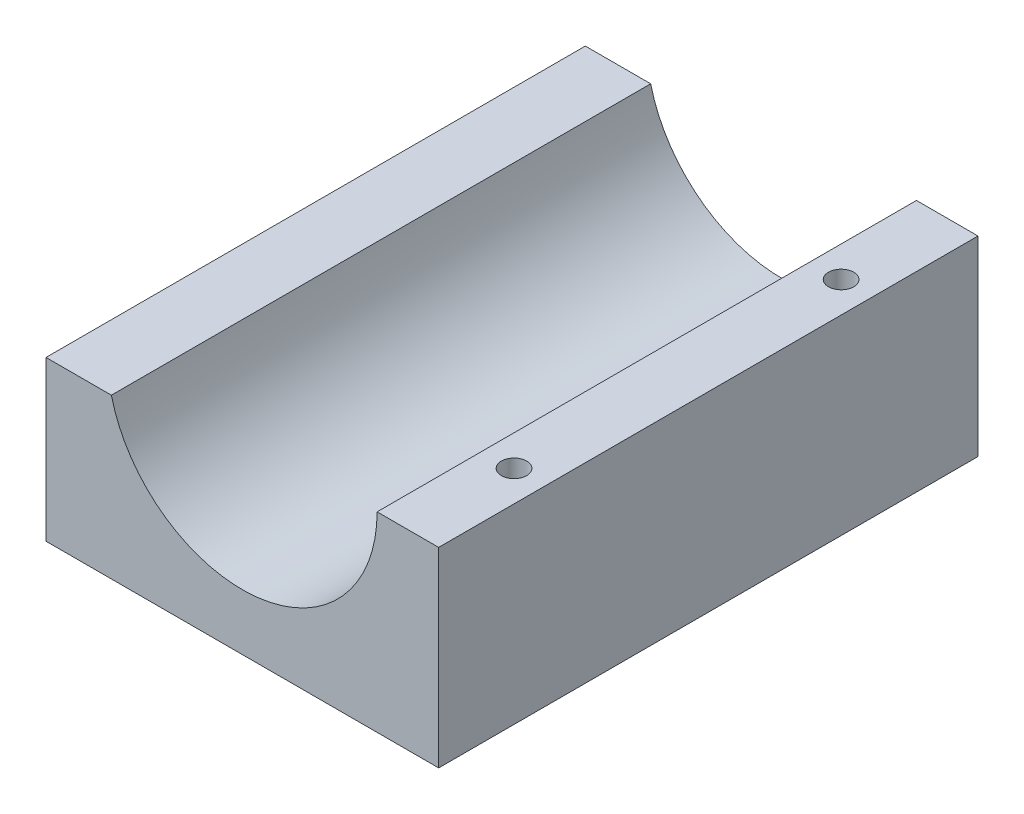
ISO-10303-21;
HEADER;
FILE_DESCRIPTION(('STEP AP214'),'2;1');
FILE_NAME('part.step','',(''),(''),'','','');
FILE_SCHEMA(('AUTOMOTIVE_DESIGN { 1 0 10303 214 1 1 1 1 }'));
ENDSEC;
DATA;
#1=APPLICATION_CONTEXT('core data for automotive mechanical design processes');
#2=APPLICATION_PROTOCOL_DEFINITION('international standard','automotive_design',2000,#1);
#3=PRODUCT_CONTEXT('',#1,'mechanical');
#4=PRODUCT('Part','Part','',(#3));
#5=PRODUCT_RELATED_PRODUCT_CATEGORY('part','',(#4));
#6=PRODUCT_DEFINITION_FORMATION('','',#4);
#7=PRODUCT_DEFINITION_CONTEXT('part definition',#1,'design');
#8=PRODUCT_DEFINITION('design','',#6,#7);
#9=PRODUCT_DEFINITION_SHAPE('','',#8);
#10=(LENGTH_UNIT() NAMED_UNIT(*) SI_UNIT(.MILLI.,.METRE.));
#11=(NAMED_UNIT(*) PLANE_ANGLE_UNIT() SI_UNIT($,.RADIAN.));
#12=(NAMED_UNIT(*) SI_UNIT($,.STERADIAN.) SOLID_ANGLE_UNIT());
#13=UNCERTAINTY_MEASURE_WITH_UNIT(LENGTH_MEASURE(1.E-05),#10,'distance_accuracy_value','');
#14=(GEOMETRIC_REPRESENTATION_CONTEXT(3) GLOBAL_UNCERTAINTY_ASSIGNED_CONTEXT((#13)) GLOBAL_UNIT_ASSIGNED_CONTEXT((#10,
#11,#12)) REPRESENTATION_CONTEXT('',''));
#15=CARTESIAN_POINT('',(0.,0.,0.));
#16=DIRECTION('',(0.,0.,1.));
#17=DIRECTION('',(1.,0.,0.));
#18=AXIS2_PLACEMENT_3D('',#15,#16,#17);
#19=CARTESIAN_POINT('',(0.,9.,0.));
#20=DIRECTION('',(1.,0.,0.));
#21=DIRECTION('',(0.,0.,-1.));
#22=AXIS2_PLACEMENT_3D('',#19,#20,#21);
#23=PLANE('',#22);
#24=DIRECTION('',(0.,0.,1.));
#25=VECTOR('',#24,1.);
#26=CARTESIAN_POINT('',(0.,7.5,-66.2778912014065));
#27=LINE('',#26,#25);
#28=CARTESIAN_POINT('',(0.,7.5,-25.41));
#29=VERTEX_POINT('',#28);
#30=CARTESIAN_POINT('',(0.,7.5,0.));
#31=VERTEX_POINT('',#30);
#32=EDGE_CURVE('E93',#29,#31,#27,.T.);
#33=ORIENTED_EDGE('',*,*,#32,.F.);
#34=DIRECTION('',(0.,-1.,0.));
#35=VECTOR('',#34,1.);
#36=CARTESIAN_POINT('',(0.,9.,-25.41));
#37=LINE('',#36,#35);
#38=CARTESIAN_POINT('',(0.,0.,-25.41));
#39=VERTEX_POINT('',#38);
#40=EDGE_CURVE('E87',#29,#39,#37,.T.);
#41=ORIENTED_EDGE('',*,*,#40,.T.);
#42=DIRECTION('',(0.,0.,1.));
#43=VECTOR('',#42,1.);
#44=CARTESIAN_POINT('',(0.,0.,0.));
#45=LINE('',#44,#43);
#46=CARTESIAN_POINT('',(0.,0.,0.));
#47=VERTEX_POINT('',#46);
#48=EDGE_CURVE('E91',#39,#47,#45,.T.);
#49=ORIENTED_EDGE('',*,*,#48,.T.);
#50=DIRECTION('',(0.,-1.,0.));
#51=VECTOR('',#50,1.);
#52=CARTESIAN_POINT('',(0.,9.,0.));
#53=LINE('',#52,#51);
#54=EDGE_CURVE('E52',#31,#47,#53,.T.);
#55=ORIENTED_EDGE('',*,*,#54,.F.);
#56=EDGE_LOOP('',(#33,#41,#49,#55));
#57=FACE_BOUND('',#56,.T.);
#58=ADVANCED_FACE('F45',(#57),#23,.F.);
#59=CARTESIAN_POINT('',(0.,9.,-25.41));
#60=DIRECTION('',(0.,0.,1.));
#61=DIRECTION('',(1.,0.,0.));
#62=AXIS2_PLACEMENT_3D('',#59,#60,#61);
#63=PLANE('',#62);
#64=DIRECTION('',(-1.,0.,0.));
#65=VECTOR('',#64,1.);
#66=CARTESIAN_POINT('',(0.,7.5,-25.41));
#67=LINE('',#66,#65);
#68=CARTESIAN_POINT('',(3.07970827269893,7.5,-25.41));
#69=VERTEX_POINT('',#68);
#70=EDGE_CURVE('E171',#69,#29,#67,.T.);
#71=ORIENTED_EDGE('',*,*,#70,.F.);
#72=CARTESIAN_POINT('',(9.25,9.,-25.41));
#73=DIRECTION('',(0.,0.,1.));
#74=DIRECTION('',(1.,0.,0.));
#75=AXIS2_PLACEMENT_3D('',#72,#73,#74);
#76=CIRCLE('',#75,6.35);
#77=CARTESIAN_POINT('',(15.6,9.,-25.41));
#78=VERTEX_POINT('',#77);
#79=EDGE_CURVE('E116',#69,#78,#76,.T.);
#80=ORIENTED_EDGE('',*,*,#79,.T.);
#81=DIRECTION('',(-1.,0.,0.));
#82=VECTOR('',#81,1.);
#83=CARTESIAN_POINT('',(0.,9.,-25.41));
#84=LINE('',#83,#82);
#85=CARTESIAN_POINT('',(18.5,9.,-25.41));
#86=VERTEX_POINT('',#85);
#87=EDGE_CURVE('E97',#86,#78,#84,.T.);
#88=ORIENTED_EDGE('',*,*,#87,.F.);
#89=DIRECTION('',(0.,-1.,0.));
#90=VECTOR('',#89,1.);
#91=CARTESIAN_POINT('',(18.5,9.,-25.41));
#92=LINE('',#91,#90);
#93=CARTESIAN_POINT('',(18.5,0.,-25.41));
#94=VERTEX_POINT('',#93);
#95=EDGE_CURVE('E96',#86,#94,#92,.T.);
#96=ORIENTED_EDGE('',*,*,#95,.T.);
#97=DIRECTION('',(-1.,0.,0.));
#98=VECTOR('',#97,1.);
#99=CARTESIAN_POINT('',(0.,0.,-25.41));
#100=LINE('',#99,#98);
#101=EDGE_CURVE('E101',#94,#39,#100,.T.);
#102=ORIENTED_EDGE('',*,*,#101,.T.);
#103=ORIENTED_EDGE('',*,*,#40,.F.);
#104=EDGE_LOOP('',(#71,#80,#88,#96,#102,#103));
#105=FACE_BOUND('',#104,.T.);
#106=ADVANCED_FACE('F102',(#105),#63,.F.);
#107=CARTESIAN_POINT('',(0.,9.,0.));
#108=DIRECTION('',(0.,-1.,0.));
#109=DIRECTION('',(0.,0.,-1.));
#110=AXIS2_PLACEMENT_3D('',#107,#108,#109);
#111=PLANE('',#110);
#112=CARTESIAN_POINT('',(17.05,9.,-20.41));
#113=DIRECTION('',(0.,1.,0.));
#114=DIRECTION('',(0.,0.,1.));
#115=AXIS2_PLACEMENT_3D('',#112,#113,#114);
#116=CIRCLE('',#115,0.59563);
#117=CARTESIAN_POINT('',(17.05,9.,-19.81437));
#118=VERTEX_POINT('',#117);
#119=EDGE_CURVE('E167',#118,#118,#116,.T.);
#120=ORIENTED_EDGE('',*,*,#119,.F.);
#121=EDGE_LOOP('',(#120));
#122=FACE_BOUND('',#121,.T.);
#123=CARTESIAN_POINT('',(17.05,9.,-5.));
#124=DIRECTION('',(0.,1.,0.));
#125=DIRECTION('',(0.,0.,1.));
#126=AXIS2_PLACEMENT_3D('',#123,#124,#125);
#127=CIRCLE('',#126,0.59563);
#128=CARTESIAN_POINT('',(17.05,9.,-4.40437));
#129=VERTEX_POINT('',#128);
#130=EDGE_CURVE('E161',#129,#129,#127,.T.);
#131=ORIENTED_EDGE('',*,*,#130,.F.);
#132=EDGE_LOOP('',(#131));
#133=FACE_BOUND('',#132,.T.);
#134=ORIENTED_EDGE('',*,*,#87,.T.);
#135=DIRECTION('',(0.,0.,1.));
#136=VECTOR('',#135,1.);
#137=CARTESIAN_POINT('',(15.6,9.,-25.41));
#138=LINE('',#137,#136);
#139=CARTESIAN_POINT('',(15.6,9.,0.));
#140=VERTEX_POINT('',#139);
#141=EDGE_CURVE('E112',#78,#140,#138,.T.);
#142=ORIENTED_EDGE('',*,*,#141,.T.);
#143=DIRECTION('',(1.,0.,0.));
#144=VECTOR('',#143,1.);
#145=CARTESIAN_POINT('',(0.,9.,0.));
#146=LINE('',#145,#144);
#147=CARTESIAN_POINT('',(18.5,9.,0.));
#148=VERTEX_POINT('',#147);
#149=EDGE_CURVE('E106',#140,#148,#146,.T.);
#150=ORIENTED_EDGE('',*,*,#149,.T.);
#151=DIRECTION('',(0.,0.,-1.));
#152=VECTOR('',#151,1.);
#153=CARTESIAN_POINT('',(18.5,9.,0.));
#154=LINE('',#153,#152);
#155=EDGE_CURVE('E67',#148,#86,#154,.T.);
#156=ORIENTED_EDGE('',*,*,#155,.T.);
#157=EDGE_LOOP('',(#134,#142,#150,#156));
#158=FACE_BOUND('',#157,.T.);
#159=ADVANCED_FACE('F155',(#122,#133,#158),#111,.F.);
#160=CARTESIAN_POINT('',(0.,9.,0.));
#161=DIRECTION('',(0.,0.,-1.));
#162=DIRECTION('',(-1.,0.,0.));
#163=AXIS2_PLACEMENT_3D('',#160,#161,#162);
#164=PLANE('',#163);
#165=CARTESIAN_POINT('',(9.25,9.,0.));
#166=DIRECTION('',(0.,0.,1.));
#167=DIRECTION('',(1.,0.,0.));
#168=AXIS2_PLACEMENT_3D('',#165,#166,#167);
#169=CIRCLE('',#168,6.35);
#170=CARTESIAN_POINT('',(3.07970827269893,7.5,0.));
#171=VERTEX_POINT('',#170);
#172=EDGE_CURVE('E149',#171,#140,#169,.T.);
#173=ORIENTED_EDGE('',*,*,#172,.F.);
#174=DIRECTION('',(-1.,0.,0.));
#175=VECTOR('',#174,1.);
#176=CARTESIAN_POINT('',(0.,7.5,0.));
#177=LINE('',#176,#175);
#178=EDGE_CURVE('E59',#171,#31,#177,.T.);
#179=ORIENTED_EDGE('',*,*,#178,.T.);
#180=ORIENTED_EDGE('',*,*,#54,.T.);
#181=DIRECTION('',(1.,0.,0.));
#182=VECTOR('',#181,1.);
#183=CARTESIAN_POINT('',(0.,0.,0.));
#184=LINE('',#183,#182);
#185=CARTESIAN_POINT('',(18.5,0.,0.));
#186=VERTEX_POINT('',#185);
#187=EDGE_CURVE('E111',#47,#186,#184,.T.);
#188=ORIENTED_EDGE('',*,*,#187,.T.);
#189=DIRECTION('',(0.,-1.,0.));
#190=VECTOR('',#189,1.);
#191=CARTESIAN_POINT('',(18.5,9.,0.));
#192=LINE('',#191,#190);
#193=EDGE_CURVE('E123',#148,#186,#192,.T.);
#194=ORIENTED_EDGE('',*,*,#193,.F.);
#195=ORIENTED_EDGE('',*,*,#149,.F.);
#196=EDGE_LOOP('',(#173,#179,#180,#188,#194,#195));
#197=FACE_BOUND('',#196,.T.);
#198=ADVANCED_FACE('F127',(#197),#164,.F.);
#199=CARTESIAN_POINT('',(18.5,9.,0.));
#200=DIRECTION('',(-1.,0.,0.));
#201=DIRECTION('',(0.,0.,1.));
#202=AXIS2_PLACEMENT_3D('',#199,#200,#201);
#203=PLANE('',#202);
#204=DIRECTION('',(0.,0.,-1.));
#205=VECTOR('',#204,1.);
#206=CARTESIAN_POINT('',(18.5,0.,0.));
#207=LINE('',#206,#205);
#208=EDGE_CURVE('E107',#186,#94,#207,.T.);
#209=ORIENTED_EDGE('',*,*,#208,.T.);
#210=ORIENTED_EDGE('',*,*,#95,.F.);
#211=ORIENTED_EDGE('',*,*,#155,.F.);
#212=ORIENTED_EDGE('',*,*,#193,.T.);
#213=EDGE_LOOP('',(#209,#210,#211,#212));
#214=FACE_BOUND('',#213,.T.);
#215=ADVANCED_FACE('F191',(#214),#203,.F.);
#216=CARTESIAN_POINT('',(0.,0.,0.));
#217=DIRECTION('',(0.,-1.,0.));
#218=DIRECTION('',(0.,0.,-1.));
#219=AXIS2_PLACEMENT_3D('',#216,#217,#218);
#220=PLANE('',#219);
#221=CARTESIAN_POINT('',(17.,0.,-12.705));
#222=DIRECTION('',(0.,-1.,0.));
#223=DIRECTION('',(0.,0.,-1.));
#224=AXIS2_PLACEMENT_3D('',#221,#222,#223);
#225=CIRCLE('',#224,0.88899999999999);
#226=CARTESIAN_POINT('',(17.,0.,-13.594));
#227=VERTEX_POINT('',#226);
#228=EDGE_CURVE('E183',#227,#227,#225,.T.);
#229=ORIENTED_EDGE('',*,*,#228,.F.);
#230=EDGE_LOOP('',(#229));
#231=FACE_BOUND('',#230,.T.);
#232=CARTESIAN_POINT('',(1.5,0.,-12.705));
#233=DIRECTION('',(0.,-1.,0.));
#234=DIRECTION('',(0.,0.,-1.));
#235=AXIS2_PLACEMENT_3D('',#232,#233,#234);
#236=CIRCLE('',#235,0.888999999999989);
#237=CARTESIAN_POINT('',(1.5,0.,-13.594));
#238=VERTEX_POINT('',#237);
#239=EDGE_CURVE('E177',#238,#238,#236,.T.);
#240=ORIENTED_EDGE('',*,*,#239,.F.);
#241=EDGE_LOOP('',(#240));
#242=FACE_BOUND('',#241,.T.);
#243=ORIENTED_EDGE('',*,*,#48,.F.);
#244=ORIENTED_EDGE('',*,*,#101,.F.);
#245=ORIENTED_EDGE('',*,*,#208,.F.);
#246=ORIENTED_EDGE('',*,*,#187,.F.);
#247=EDGE_LOOP('',(#243,#244,#245,#246));
#248=FACE_BOUND('',#247,.T.);
#249=ADVANCED_FACE('F110',(#231,#242,#248),#220,.T.);
#250=CARTESIAN_POINT('',(9.25,9.,-25.41));
#251=DIRECTION('',(0.,0.,1.));
#252=DIRECTION('',(1.,0.,0.));
#253=AXIS2_PLACEMENT_3D('',#250,#251,#252);
#254=CYLINDRICAL_SURFACE('',#253,6.35);
#255=ORIENTED_EDGE('',*,*,#79,.F.);
#256=DIRECTION('',(0.,0.,1.));
#257=VECTOR('',#256,1.);
#258=CARTESIAN_POINT('',(3.07970827269893,7.5,-25.41));
#259=LINE('',#258,#257);
#260=EDGE_CURVE('E11',#69,#171,#259,.T.);
#261=ORIENTED_EDGE('',*,*,#260,.T.);
#262=ORIENTED_EDGE('',*,*,#172,.T.);
#263=ORIENTED_EDGE('',*,*,#141,.F.);
#264=EDGE_LOOP('',(#255,#261,#262,#263));
#265=FACE_BOUND('',#264,.T.);
#266=ADVANCED_FACE('F151',(#265),#254,.F.);
#267=CARTESIAN_POINT('',(17.05,5.35789061051138,-5.));
#268=DIRECTION('',(0.,1.,0.));
#269=DIRECTION('',(0.,0.,1.));
#270=AXIS2_PLACEMENT_3D('',#267,#268,#269);
#271=CONICAL_SURFACE('',#270,0.59563,1.02974425867665);
#272=CARTESIAN_POINT('',(17.05,5.,-5.));
#273=VERTEX_POINT('',#272);
#274=VERTEX_LOOP('',#273);
#275=FACE_BOUND('',#274,.T.);
#276=CARTESIAN_POINT('',(17.05,5.35789061051138,-5.));
#277=DIRECTION('',(0.,1.,0.));
#278=DIRECTION('',(0.,0.,1.));
#279=AXIS2_PLACEMENT_3D('',#276,#277,#278);
#280=CIRCLE('',#279,0.59563);
#281=CARTESIAN_POINT('',(17.05,5.35789061051138,-4.40437));
#282=VERTEX_POINT('',#281);
#283=EDGE_CURVE('E153',#282,#282,#280,.T.);
#284=ORIENTED_EDGE('',*,*,#283,.T.);
#285=EDGE_LOOP('',(#284));
#286=FACE_BOUND('',#285,.T.);
#287=ADVANCED_FACE('F245',(#275,#286),#271,.F.);
#288=CARTESIAN_POINT('',(17.05,9.,-5.));
#289=DIRECTION('',(0.,1.,0.));
#290=DIRECTION('',(0.,0.,1.));
#291=AXIS2_PLACEMENT_3D('',#288,#289,#290);
#292=CYLINDRICAL_SURFACE('',#291,0.59563);
#293=ORIENTED_EDGE('',*,*,#283,.F.);
#294=EDGE_LOOP('',(#293));
#295=FACE_BOUND('',#294,.T.);
#296=ORIENTED_EDGE('',*,*,#130,.T.);
#297=EDGE_LOOP('',(#296));
#298=FACE_BOUND('',#297,.T.);
#299=ADVANCED_FACE('F253',(#295,#298),#292,.F.);
#300=CARTESIAN_POINT('',(17.05,5.35789061051138,-20.41));
#301=DIRECTION('',(0.,1.,0.));
#302=DIRECTION('',(0.,0.,1.));
#303=AXIS2_PLACEMENT_3D('',#300,#301,#302);
#304=CONICAL_SURFACE('',#303,0.59563,1.02974425867665);
#305=CARTESIAN_POINT('',(17.05,5.,-20.41));
#306=VERTEX_POINT('',#305);
#307=VERTEX_LOOP('',#306);
#308=FACE_BOUND('',#307,.T.);
#309=CARTESIAN_POINT('',(17.05,5.35789061051138,-20.41));
#310=DIRECTION('',(0.,1.,0.));
#311=DIRECTION('',(0.,0.,1.));
#312=AXIS2_PLACEMENT_3D('',#309,#310,#311);
#313=CIRCLE('',#312,0.59563);
#314=CARTESIAN_POINT('',(17.05,5.35789061051138,-19.81437));
#315=VERTEX_POINT('',#314);
#316=EDGE_CURVE('E164',#315,#315,#313,.T.);
#317=ORIENTED_EDGE('',*,*,#316,.T.);
#318=EDGE_LOOP('',(#317));
#319=FACE_BOUND('',#318,.T.);
#320=ADVANCED_FACE('F262',(#308,#319),#304,.F.);
#321=CARTESIAN_POINT('',(17.05,9.,-20.41));
#322=DIRECTION('',(0.,1.,0.));
#323=DIRECTION('',(0.,0.,1.));
#324=AXIS2_PLACEMENT_3D('',#321,#322,#323);
#325=CYLINDRICAL_SURFACE('',#324,0.59563);
#326=ORIENTED_EDGE('',*,*,#316,.F.);
#327=EDGE_LOOP('',(#326));
#328=FACE_BOUND('',#327,.T.);
#329=ORIENTED_EDGE('',*,*,#119,.T.);
#330=EDGE_LOOP('',(#329));
#331=FACE_BOUND('',#330,.T.);
#332=ADVANCED_FACE('F271',(#328,#331),#325,.F.);
#333=CARTESIAN_POINT('',(0.,7.5,-66.2778912014065));
#334=DIRECTION('',(0.,-1.,0.));
#335=DIRECTION('',(0.,0.,-1.));
#336=AXIS2_PLACEMENT_3D('',#333,#334,#335);
#337=PLANE('',#336);
#338=ORIENTED_EDGE('',*,*,#260,.F.);
#339=ORIENTED_EDGE('',*,*,#70,.T.);
#340=ORIENTED_EDGE('',*,*,#32,.T.);
#341=ORIENTED_EDGE('',*,*,#178,.F.);
#342=EDGE_LOOP('',(#338,#339,#340,#341));
#343=FACE_BOUND('',#342,.T.);
#344=ADVANCED_FACE('F207',(#343),#337,.F.);
#345=CARTESIAN_POINT('',(1.5,3.4658349096845,-12.705));
#346=DIRECTION('',(0.,-1.,0.));
#347=DIRECTION('',(0.,0.,-1.));
#348=AXIS2_PLACEMENT_3D('',#345,#346,#347);
#349=CONICAL_SURFACE('',#348,0.888999999999999,1.02974425867665);
#350=CARTESIAN_POINT('',(1.5,4.,-12.705));
#351=VERTEX_POINT('',#350);
#352=VERTEX_LOOP('',#351);
#353=FACE_BOUND('',#352,.T.);
#354=CARTESIAN_POINT('',(1.5,3.4658349096845,-12.705));
#355=DIRECTION('',(0.,-1.,0.));
#356=DIRECTION('',(0.,0.,-1.));
#357=AXIS2_PLACEMENT_3D('',#354,#355,#356);
#358=CIRCLE('',#357,0.888999999999999);
#359=CARTESIAN_POINT('',(1.5,3.4658349096845,-13.594));
#360=VERTEX_POINT('',#359);
#361=EDGE_CURVE('E173',#360,#360,#358,.T.);
#362=ORIENTED_EDGE('',*,*,#361,.T.);
#363=EDGE_LOOP('',(#362));
#364=FACE_BOUND('',#363,.T.);
#365=ADVANCED_FACE('F198',(#353,#364),#349,.F.);
#366=CARTESIAN_POINT('',(1.5,0.,-12.705));
#367=DIRECTION('',(0.,-1.,0.));
#368=DIRECTION('',(0.,0.,-1.));
#369=AXIS2_PLACEMENT_3D('',#366,#367,#368);
#370=CYLINDRICAL_SURFACE('',#369,0.888999999999994);
#371=ORIENTED_EDGE('',*,*,#361,.F.);
#372=EDGE_LOOP('',(#371));
#373=FACE_BOUND('',#372,.T.);
#374=ORIENTED_EDGE('',*,*,#239,.T.);
#375=EDGE_LOOP('',(#374));
#376=FACE_BOUND('',#375,.T.);
#377=ADVANCED_FACE('F195',(#373,#376),#370,.F.);
#378=CARTESIAN_POINT('',(17.,3.4658349096845,-12.705));
#379=DIRECTION('',(0.,-1.,0.));
#380=DIRECTION('',(0.,0.,-1.));
#381=AXIS2_PLACEMENT_3D('',#378,#379,#380);
#382=CONICAL_SURFACE('',#381,0.888999999999997,1.02974425867665);
#383=CARTESIAN_POINT('',(17.,4.,-12.705));
#384=VERTEX_POINT('',#383);
#385=VERTEX_LOOP('',#384);
#386=FACE_BOUND('',#385,.T.);
#387=CARTESIAN_POINT('',(17.,3.4658349096845,-12.705));
#388=DIRECTION('',(0.,-1.,0.));
#389=DIRECTION('',(0.,0.,-1.));
#390=AXIS2_PLACEMENT_3D('',#387,#388,#389);
#391=CIRCLE('',#390,0.888999999999997);
#392=CARTESIAN_POINT('',(17.,3.4658349096845,-13.594));
#393=VERTEX_POINT('',#392);
#394=EDGE_CURVE('E180',#393,#393,#391,.T.);
#395=ORIENTED_EDGE('',*,*,#394,.T.);
#396=EDGE_LOOP('',(#395));
#397=FACE_BOUND('',#396,.T.);
#398=ADVANCED_FACE('F197',(#386,#397),#382,.F.);
#399=CARTESIAN_POINT('',(17.,0.,-12.705));
#400=DIRECTION('',(0.,-1.,0.));
#401=DIRECTION('',(0.,0.,-1.));
#402=AXIS2_PLACEMENT_3D('',#399,#400,#401);
#403=CYLINDRICAL_SURFACE('',#402,0.888999999999994);
#404=ORIENTED_EDGE('',*,*,#394,.F.);
#405=EDGE_LOOP('',(#404));
#406=FACE_BOUND('',#405,.T.);
#407=ORIENTED_EDGE('',*,*,#228,.T.);
#408=EDGE_LOOP('',(#407));
#409=FACE_BOUND('',#408,.T.);
#410=ADVANCED_FACE('F187',(#406,#409),#403,.F.);
#411=CLOSED_SHELL('',(#58,#106,#159,#198,#215,#249,#266,#287,#299,#320,#332,#344,#365,#377,#398,#410));
#412=MANIFOLD_SOLID_BREP('B2',#411);
#413=ADVANCED_BREP_SHAPE_REPRESENTATION('',(#18,#412),#14);
#414=SHAPE_DEFINITION_REPRESENTATION(#9,#413);
ENDSEC;
END-ISO-10303-21;
